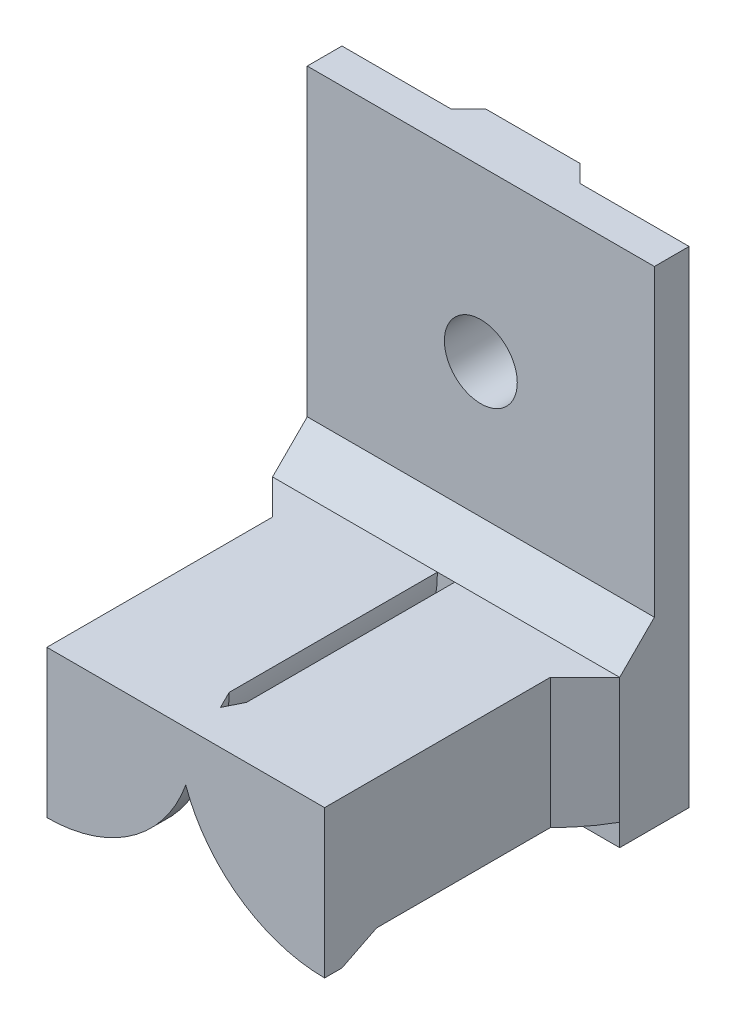
ISO-10303-21;
HEADER;
FILE_DESCRIPTION(('STEP AP214'),'2;1');
FILE_NAME('part.step','',(''),(''),'','','');
FILE_SCHEMA(('AUTOMOTIVE_DESIGN { 1 0 10303 214 1 1 1 1 }'));
ENDSEC;
DATA;
#1=APPLICATION_CONTEXT('core data for automotive mechanical design processes');
#2=APPLICATION_PROTOCOL_DEFINITION('international standard','automotive_design',2000,#1);
#3=PRODUCT_CONTEXT('',#1,'mechanical');
#4=PRODUCT('Part','Part','',(#3));
#5=PRODUCT_RELATED_PRODUCT_CATEGORY('part','',(#4));
#6=PRODUCT_DEFINITION_FORMATION('','',#4);
#7=PRODUCT_DEFINITION_CONTEXT('part definition',#1,'design');
#8=PRODUCT_DEFINITION('design','',#6,#7);
#9=PRODUCT_DEFINITION_SHAPE('','',#8);
#10=(LENGTH_UNIT() NAMED_UNIT(*) SI_UNIT(.MILLI.,.METRE.));
#11=(NAMED_UNIT(*) PLANE_ANGLE_UNIT() SI_UNIT($,.RADIAN.));
#12=(NAMED_UNIT(*) SI_UNIT($,.STERADIAN.) SOLID_ANGLE_UNIT());
#13=UNCERTAINTY_MEASURE_WITH_UNIT(LENGTH_MEASURE(1.E-05),#10,'distance_accuracy_value','');
#14=(GEOMETRIC_REPRESENTATION_CONTEXT(3) GLOBAL_UNCERTAINTY_ASSIGNED_CONTEXT((#13)) GLOBAL_UNIT_ASSIGNED_CONTEXT((#10,
#11,#12)) REPRESENTATION_CONTEXT('',''));
#15=CARTESIAN_POINT('',(0.,0.,0.));
#16=DIRECTION('',(0.,0.,1.));
#17=DIRECTION('',(1.,0.,0.));
#18=AXIS2_PLACEMENT_3D('',#15,#16,#17);
#19=CARTESIAN_POINT('',(-8.00000000000002,18.500000014901,348.000000000001));
#20=DIRECTION('',(0.,0.,-1.));
#21=DIRECTION('',(-1.,0.,0.));
#22=AXIS2_PLACEMENT_3D('',#19,#20,#21);
#23=CYLINDRICAL_SURFACE('',#22,8.50000001490115);
#24=CARTESIAN_POINT('',(-8.00000000000002,18.500000014901,347.000000005962));
#25=DIRECTION('',(0.,0.,1.));
#26=DIRECTION('',(0.,-1.,0.));
#27=AXIS2_PLACEMENT_3D('',#24,#25,#26);
#28=CIRCLE('',#27,8.50000000298022);
#29=CARTESIAN_POINT('',(0.,15.6277186651736,347.000000017882));
#30=VERTEX_POINT('',#29);
#31=CARTESIAN_POINT('',(-8.00000000000002,10.0000000039735,347.000000001988));
#32=VERTEX_POINT('',#31);
#33=EDGE_CURVE('E186',#30,#32,#28,.F.);
#34=ORIENTED_EDGE('',*,*,#33,.F.);
#35=DIRECTION('',(0.,0.,-1.));
#36=VECTOR('',#35,1.);
#37=CARTESIAN_POINT('',(0.,15.6277186475347,348.000000000001));
#38=LINE('',#37,#36);
#39=CARTESIAN_POINT('',(0.,15.6277186475347,348.000000000001));
#40=VERTEX_POINT('',#39);
#41=EDGE_CURVE('E164',#40,#30,#38,.T.);
#42=ORIENTED_EDGE('',*,*,#41,.F.);
#43=CARTESIAN_POINT('',(-8.00000000000002,18.500000014901,348.000000000001));
#44=DIRECTION('',(0.,0.,-1.));
#45=DIRECTION('',(-1.,0.,0.));
#46=AXIS2_PLACEMENT_3D('',#43,#44,#45);
#47=CIRCLE('',#46,8.50000001490115);
#48=CARTESIAN_POINT('',(-8.00000000000002,9.99999999999985,348.000000000001));
#49=VERTEX_POINT('',#48);
#50=EDGE_CURVE('E197',#49,#40,#47,.F.);
#51=ORIENTED_EDGE('',*,*,#50,.F.);
#52=DIRECTION('',(0.,0.,-1.));
#53=VECTOR('',#52,1.);
#54=CARTESIAN_POINT('',(-8.00000000000002,9.99999999999985,348.000000000001));
#55=LINE('',#54,#53);
#56=EDGE_CURVE('E176',#49,#32,#55,.T.);
#57=ORIENTED_EDGE('',*,*,#56,.T.);
#58=EDGE_LOOP('',(#34,#42,#51,#57));
#59=FACE_BOUND('',#58,.T.);
#60=ADVANCED_FACE('F16',(#59),#23,.T.);
#61=CARTESIAN_POINT('',(7.99999999999996,18.500000014901,348.000000000001));
#62=DIRECTION('',(0.,0.,-1.));
#63=DIRECTION('',(-1.,0.,0.));
#64=AXIS2_PLACEMENT_3D('',#61,#62,#63);
#65=CYLINDRICAL_SURFACE('',#64,8.50000001490115);
#66=CARTESIAN_POINT('',(7.99999999999996,18.500000014901,347.000000005962));
#67=DIRECTION('',(0.,0.,1.));
#68=DIRECTION('',(-1.,0.,0.));
#69=AXIS2_PLACEMENT_3D('',#66,#67,#68);
#70=CIRCLE('',#69,8.50000000298021);
#71=CARTESIAN_POINT('',(7.99999999999996,10.0000000039735,347.000000001988));
#72=VERTEX_POINT('',#71);
#73=EDGE_CURVE('E167',#72,#30,#70,.F.);
#74=ORIENTED_EDGE('',*,*,#73,.F.);
#75=DIRECTION('',(0.,0.,-1.));
#76=VECTOR('',#75,1.);
#77=CARTESIAN_POINT('',(7.99999999999996,9.99999999999985,348.000000000001));
#78=LINE('',#77,#76);
#79=CARTESIAN_POINT('',(7.99999999999996,9.99999999999985,348.000000000001));
#80=VERTEX_POINT('',#79);
#81=EDGE_CURVE('E175',#72,#80,#78,.F.);
#82=ORIENTED_EDGE('',*,*,#81,.T.);
#83=CARTESIAN_POINT('',(7.99999999999996,18.500000014901,348.000000000001));
#84=DIRECTION('',(0.,0.,-1.));
#85=DIRECTION('',(-1.,0.,0.));
#86=AXIS2_PLACEMENT_3D('',#83,#84,#85);
#87=CIRCLE('',#86,8.50000001490115);
#88=EDGE_CURVE('E170',#40,#80,#87,.F.);
#89=ORIENTED_EDGE('',*,*,#88,.F.);
#90=ORIENTED_EDGE('',*,*,#41,.T.);
#91=EDGE_LOOP('',(#74,#82,#89,#90));
#92=FACE_BOUND('',#91,.T.);
#93=ADVANCED_FACE('F166',(#92),#65,.T.);
#94=CARTESIAN_POINT('',(7.99999999999996,18.500000014901,347.000000005962));
#95=DIRECTION('',(0.,0.,1.));
#96=DIRECTION('',(1.,0.,0.));
#97=AXIS2_PLACEMENT_3D('',#94,#95,#96);
#98=CONICAL_SURFACE('',#97,8.50000000298021,0.463647609000802);
#99=DIRECTION('',(0.,0.44721360083114,-0.894427188334325));
#100=VECTOR('',#99,1.);
#101=CARTESIAN_POINT('',(7.99999999999996,9.99999999999989,347.000000000001));
#102=LINE('',#101,#100);
#103=CARTESIAN_POINT('',(7.99999999999996,11.000000014901,345.000000000001));
#104=VERTEX_POINT('',#103);
#105=EDGE_CURVE('E183',#72,#104,#102,.T.);
#106=ORIENTED_EDGE('',*,*,#105,.F.);
#107=ORIENTED_EDGE('',*,*,#73,.T.);
#108=CARTESIAN_POINT('',(0.,18.500000014901,346.000000000001));
#109=CARTESIAN_POINT('',(0.,18.4262201647426,345.999993626271));
#110=CARTESIAN_POINT('',(0.,18.3524561683724,346.00204240683));
#111=CARTESIAN_POINT('',(0.,18.2051667180088,346.010186352399));
#112=CARTESIAN_POINT('',(0.,18.1316412178106,346.016280679968));
#113=CARTESIAN_POINT('',(0.,17.9120855170067,346.0404934505));
#114=CARTESIAN_POINT('',(0.,17.7666728358507,346.06454239593));
#115=CARTESIAN_POINT('',(0.,17.4824774607516,346.12647905004));
#116=CARTESIAN_POINT('',(0.,17.3436192553142,346.16402910153));
#117=CARTESIAN_POINT('',(0.,17.0697933399129,346.251426134025));
#118=CARTESIAN_POINT('',(0.,16.9348272726317,346.301278224686));
#119=CARTESIAN_POINT('',(0.,16.699788935803,346.398870235824));
#120=CARTESIAN_POINT('',(0.,16.5988141592601,346.444471540052));
#121=CARTESIAN_POINT('',(0.,16.3995526330471,346.541165853297));
#122=CARTESIAN_POINT('',(0.,16.3012654947911,346.592258063101));
#123=CARTESIAN_POINT('',(0.,16.1054930631954,346.700255430901));
#124=CARTESIAN_POINT('',(0.,16.0080591560776,346.757253159034));
#125=CARTESIAN_POINT('',(0.,15.8158971321666,346.875553965992));
#126=CARTESIAN_POINT('',(0.,15.7211677995215,346.936855065944));
#127=CARTESIAN_POINT('',(0.,15.6277186618509,347.000000020128));
#128=B_SPLINE_CURVE_WITH_KNOTS('',3,(#108,#109,#110,#111,#112,#113,#114,#115,#116,#117,#118,
#119,#120,#121,#122,#123,#124,#125,#126,#127),.UNSPECIFIED.,.F.,.F.,(4,2,2,2,2,2,2,2,2,4),(0.,
0.221280695846479,0.442515600157778,0.883782117836499,1.3147034825508,1.74580413273469,
2.07801623878077,2.41018005598622,2.74870384904664,3.08707298141812),.UNSPECIFIED.);
#129=CARTESIAN_POINT('',(0.,18.500000014901,346.000000000001));
#130=VERTEX_POINT('',#129);
#131=EDGE_CURVE('E19',#130,#30,#128,.T.);
#132=ORIENTED_EDGE('',*,*,#131,.F.);
#133=DIRECTION('',(0.447213595499954,0.,-0.894427190999918));
#134=VECTOR('',#133,1.);
#135=CARTESIAN_POINT('',(0.,18.500000014901,346.000000000001));
#136=LINE('',#135,#134);
#137=CARTESIAN_POINT('',(0.499999999999969,18.500000014901,345.000000000001));
#138=VERTEX_POINT('',#137);
#139=EDGE_CURVE('E158',#130,#138,#136,.T.);
#140=ORIENTED_EDGE('',*,*,#139,.T.);
#141=CARTESIAN_POINT('',(7.99999999999996,18.500000014901,345.000000000001));
#142=DIRECTION('',(0.,0.,1.));
#143=DIRECTION('',(0.,-1.,0.));
#144=AXIS2_PLACEMENT_3D('',#141,#142,#143);
#145=CIRCLE('',#144,7.49999999999999);
#146=EDGE_CURVE('E227',#104,#138,#145,.F.);
#147=ORIENTED_EDGE('',*,*,#146,.F.);
#148=EDGE_LOOP('',(#106,#107,#132,#140,#147));
#149=FACE_BOUND('',#148,.T.);
#150=ADVANCED_FACE('F179',(#149),#98,.T.);
#151=CARTESIAN_POINT('',(-8.00000000000002,18.500000014901,347.000000005962));
#152=DIRECTION('',(0.,0.,1.));
#153=DIRECTION('',(1.,0.,0.));
#154=AXIS2_PLACEMENT_3D('',#151,#152,#153);
#155=CONICAL_SURFACE('',#154,8.50000000298021,0.463647609000801);
#156=CARTESIAN_POINT('',(-8.00000000000002,18.500000014901,345.000000000001));
#157=DIRECTION('',(0.,0.,1.));
#158=DIRECTION('',(0.,-1.,0.));
#159=AXIS2_PLACEMENT_3D('',#156,#157,#158);
#160=CIRCLE('',#159,7.49999999999999);
#161=CARTESIAN_POINT('',(-0.500000000000026,18.500000014901,345.000000000001));
#162=VERTEX_POINT('',#161);
#163=CARTESIAN_POINT('',(-8.00000000000002,11.000000014901,345.000000000001));
#164=VERTEX_POINT('',#163);
#165=EDGE_CURVE('E194',#162,#164,#160,.F.);
#166=ORIENTED_EDGE('',*,*,#165,.F.);
#167=DIRECTION('',(-0.447213595499954,0.,-0.894427190999918));
#168=VECTOR('',#167,1.);
#169=CARTESIAN_POINT('',(0.,18.500000014901,346.000000000001));
#170=LINE('',#169,#168);
#171=EDGE_CURVE('E190',#162,#130,#170,.F.);
#172=ORIENTED_EDGE('',*,*,#171,.T.);
#173=ORIENTED_EDGE('',*,*,#131,.T.);
#174=ORIENTED_EDGE('',*,*,#33,.T.);
#175=DIRECTION('',(0.,-0.44721360083114,0.894427188334325));
#176=VECTOR('',#175,1.);
#177=CARTESIAN_POINT('',(-8.00000000000002,11.000000014901,345.000000000001));
#178=LINE('',#177,#176);
#179=EDGE_CURVE('E288',#164,#32,#178,.T.);
#180=ORIENTED_EDGE('',*,*,#179,.F.);
#181=EDGE_LOOP('',(#166,#172,#173,#174,#180));
#182=FACE_BOUND('',#181,.T.);
#183=ADVANCED_FACE('F193',(#182),#155,.T.);
#184=CARTESIAN_POINT('',(-4.25000000000002,14.750000014901,348.000000000001));
#185=DIRECTION('',(0.,0.,1.));
#186=DIRECTION('',(0.,-1.,0.));
#187=AXIS2_PLACEMENT_3D('',#184,#185,#186);
#188=PLANE('',#187);
#189=DIRECTION('',(0.,1.,0.));
#190=VECTOR('',#189,1.);
#191=CARTESIAN_POINT('',(7.99999999999996,11.000000014901,348.000000000001));
#192=LINE('',#191,#190);
#193=CARTESIAN_POINT('',(7.99999999999996,18.500000014901,348.000000000001));
#194=VERTEX_POINT('',#193);
#195=EDGE_CURVE('E228',#194,#80,#192,.F.);
#196=ORIENTED_EDGE('',*,*,#195,.F.);
#197=DIRECTION('',(1.,0.,0.));
#198=VECTOR('',#197,1.);
#199=CARTESIAN_POINT('',(-0.500000000000026,18.500000014901,348.000000000001));
#200=LINE('',#199,#198);
#201=CARTESIAN_POINT('',(-8.00000000000002,18.500000014901,348.000000000001));
#202=VERTEX_POINT('',#201);
#203=EDGE_CURVE('E278',#202,#194,#200,.T.);
#204=ORIENTED_EDGE('',*,*,#203,.F.);
#205=DIRECTION('',(0.,-1.,0.));
#206=VECTOR('',#205,1.);
#207=CARTESIAN_POINT('',(-8.00000000000002,18.500000014901,348.000000000001));
#208=LINE('',#207,#206);
#209=EDGE_CURVE('E285',#49,#202,#208,.F.);
#210=ORIENTED_EDGE('',*,*,#209,.F.);
#211=ORIENTED_EDGE('',*,*,#50,.T.);
#212=ORIENTED_EDGE('',*,*,#88,.T.);
#213=EDGE_LOOP('',(#196,#204,#210,#211,#212));
#214=FACE_BOUND('',#213,.T.);
#215=ADVANCED_FACE('F463',(#214),#188,.T.);
#216=CARTESIAN_POINT('',(7.99999999999996,11.000000014901,333.000000000001));
#217=DIRECTION('',(1.,0.,0.));
#218=DIRECTION('',(0.,1.,0.));
#219=AXIS2_PLACEMENT_3D('',#216,#217,#218);
#220=PLANE('',#219);
#221=ORIENTED_EDGE('',*,*,#105,.T.);
#222=DIRECTION('',(0.,0.,1.));
#223=VECTOR('',#222,1.);
#224=CARTESIAN_POINT('',(7.99999999999996,11.000000014901,333.000000000001));
#225=LINE('',#224,#223);
#226=CARTESIAN_POINT('',(7.99999999999997,11.000000014901,335.000000000001));
#227=VERTEX_POINT('',#226);
#228=EDGE_CURVE('E311',#227,#104,#225,.T.);
#229=ORIENTED_EDGE('',*,*,#228,.F.);
#230=DIRECTION('',(0.,1.,0.));
#231=VECTOR('',#230,1.);
#232=CARTESIAN_POINT('',(7.99999999999997,17.5000000074505,335.000000000001));
#233=LINE('',#232,#231);
#234=CARTESIAN_POINT('',(7.99999999999997,18.5000000149011,335.000000000001));
#235=VERTEX_POINT('',#234);
#236=EDGE_CURVE('E257',#235,#227,#233,.F.);
#237=ORIENTED_EDGE('',*,*,#236,.F.);
#238=DIRECTION('',(0.,0.,1.));
#239=VECTOR('',#238,1.);
#240=CARTESIAN_POINT('',(7.99999999999996,18.500000014901,333.000000000001));
#241=LINE('',#240,#239);
#242=EDGE_CURVE('E281',#194,#235,#241,.F.);
#243=ORIENTED_EDGE('',*,*,#242,.F.);
#244=ORIENTED_EDGE('',*,*,#195,.T.);
#245=ORIENTED_EDGE('',*,*,#81,.F.);
#246=EDGE_LOOP('',(#221,#229,#237,#243,#244,#245));
#247=FACE_BOUND('',#246,.T.);
#248=ADVANCED_FACE('F465',(#247),#220,.T.);
#249=CARTESIAN_POINT('',(7.99999999999996,18.500000014901,333.000000000001));
#250=DIRECTION('',(0.,0.,1.));
#251=DIRECTION('',(0.,-1.,0.));
#252=AXIS2_PLACEMENT_3D('',#249,#250,#251);
#253=CYLINDRICAL_SURFACE('',#252,7.49999999999999);
#254=CARTESIAN_POINT('',(7.99999999999996,18.500000014901,335.000000000001));
#255=DIRECTION('',(0.707106781186552,0.,0.707106781186543));
#256=DIRECTION('',(-0.707106781186543,0.,0.707106781186552));
#257=AXIS2_PLACEMENT_3D('',#254,#255,#256);
#258=ELLIPSE('',#257,10.6066017177983,7.49999999999999);
#259=CARTESIAN_POINT('',(9.99999999999996,11.2715838675006,333.000000000001));
#260=VERTEX_POINT('',#259);
#261=EDGE_CURVE('E253',#227,#260,#258,.T.);
#262=ORIENTED_EDGE('',*,*,#261,.F.);
#263=ORIENTED_EDGE('',*,*,#228,.T.);
#264=ORIENTED_EDGE('',*,*,#146,.T.);
#265=DIRECTION('',(0.,0.,1.));
#266=VECTOR('',#265,1.);
#267=CARTESIAN_POINT('',(0.499999999999973,18.500000014901,333.000000000001));
#268=LINE('',#267,#266);
#269=CARTESIAN_POINT('',(0.499999999999972,18.500000014901,333.000000000001));
#270=VERTEX_POINT('',#269);
#271=EDGE_CURVE('E319',#270,#138,#268,.T.);
#272=ORIENTED_EDGE('',*,*,#271,.F.);
#273=CARTESIAN_POINT('',(7.99999999999996,18.500000014901,333.000000000001));
#274=DIRECTION('',(0.,0.,1.));
#275=DIRECTION('',(0.,-1.,0.));
#276=AXIS2_PLACEMENT_3D('',#273,#274,#275);
#277=CIRCLE('',#276,7.49999999999999);
#278=EDGE_CURVE('E262',#260,#270,#277,.F.);
#279=ORIENTED_EDGE('',*,*,#278,.F.);
#280=EDGE_LOOP('',(#262,#263,#264,#272,#279));
#281=FACE_BOUND('',#280,.T.);
#282=ADVANCED_FACE('F328',(#281),#253,.T.);
#283=CARTESIAN_POINT('',(0.,23.9999999999999,333.000000000001));
#284=DIRECTION('',(0.,0.,1.));
#285=DIRECTION('',(0.,-1.,0.));
#286=AXIS2_PLACEMENT_3D('',#283,#284,#285);
#287=PLANE('',#286);
#288=ORIENTED_EDGE('',*,*,#278,.T.);
#289=DIRECTION('',(1.,0.,0.));
#290=VECTOR('',#289,1.);
#291=CARTESIAN_POINT('',(0.,18.500000014901,333.000000000001));
#292=LINE('',#291,#290);
#293=CARTESIAN_POINT('',(-0.500000000000028,18.500000014901,333.000000000001));
#294=VERTEX_POINT('',#293);
#295=EDGE_CURVE('E265',#270,#294,#292,.F.);
#296=ORIENTED_EDGE('',*,*,#295,.T.);
#297=CARTESIAN_POINT('',(-8.00000000000002,18.500000014901,333.000000000001));
#298=DIRECTION('',(0.,0.,1.));
#299=DIRECTION('',(0.,-1.,0.));
#300=AXIS2_PLACEMENT_3D('',#297,#298,#299);
#301=CIRCLE('',#300,7.49999999999999);
#302=CARTESIAN_POINT('',(-10.,11.2715838675006,333.000000000001));
#303=VERTEX_POINT('',#302);
#304=EDGE_CURVE('E258',#303,#294,#301,.T.);
#305=ORIENTED_EDGE('',*,*,#304,.F.);
#306=DIRECTION('',(0.,-1.,0.));
#307=VECTOR('',#306,1.);
#308=CARTESIAN_POINT('',(-10.,23.9999999999999,333.000000000001));
#309=LINE('',#308,#307);
#310=CARTESIAN_POINT('',(-10.,9.99999999999988,333.000000000001));
#311=VERTEX_POINT('',#310);
#312=EDGE_CURVE('E307',#303,#311,#309,.T.);
#313=ORIENTED_EDGE('',*,*,#312,.T.);
#314=DIRECTION('',(1.,0.,0.));
#315=VECTOR('',#314,1.);
#316=CARTESIAN_POINT('',(-10.,9.99999999999988,333.000000000001));
#317=LINE('',#316,#315);
#318=CARTESIAN_POINT('',(9.99999999999997,9.99999999999988,333.000000000001));
#319=VERTEX_POINT('',#318);
#320=EDGE_CURVE('E205',#319,#311,#317,.F.);
#321=ORIENTED_EDGE('',*,*,#320,.F.);
#322=DIRECTION('',(0.,-1.,0.));
#323=VECTOR('',#322,1.);
#324=CARTESIAN_POINT('',(9.99999999999997,23.9999999999999,333.000000000001));
#325=LINE('',#324,#323);
#326=EDGE_CURVE('E266',#319,#260,#325,.F.);
#327=ORIENTED_EDGE('',*,*,#326,.T.);
#328=EDGE_LOOP('',(#288,#296,#305,#313,#321,#327));
#329=FACE_BOUND('',#328,.T.);
#330=ADVANCED_FACE('F457',(#329),#287,.T.);
#331=CARTESIAN_POINT('',(-8.00000000000002,18.500000014901,333.000000000001));
#332=DIRECTION('',(0.,0.,1.));
#333=DIRECTION('',(0.,-1.,0.));
#334=AXIS2_PLACEMENT_3D('',#331,#332,#333);
#335=CYLINDRICAL_SURFACE('',#334,7.49999999999999);
#336=ORIENTED_EDGE('',*,*,#304,.T.);
#337=DIRECTION('',(0.,0.,1.));
#338=VECTOR('',#337,1.);
#339=CARTESIAN_POINT('',(-0.500000000000026,18.500000014901,333.000000000001));
#340=LINE('',#339,#338);
#341=EDGE_CURVE('E333',#162,#294,#340,.F.);
#342=ORIENTED_EDGE('',*,*,#341,.F.);
#343=ORIENTED_EDGE('',*,*,#165,.T.);
#344=DIRECTION('',(0.,0.,1.));
#345=VECTOR('',#344,1.);
#346=CARTESIAN_POINT('',(-8.00000000000002,11.000000014901,333.000000000001));
#347=LINE('',#346,#345);
#348=CARTESIAN_POINT('',(-8.00000000000002,11.000000014901,335.000000000001));
#349=VERTEX_POINT('',#348);
#350=EDGE_CURVE('E261',#349,#164,#347,.T.);
#351=ORIENTED_EDGE('',*,*,#350,.F.);
#352=CARTESIAN_POINT('',(-8.00000000000002,18.500000014901,335.000000000001));
#353=DIRECTION('',(-0.707106781186553,0.,0.707106781186542));
#354=DIRECTION('',(0.707106781186542,0.,0.707106781186553));
#355=AXIS2_PLACEMENT_3D('',#352,#353,#354);
#356=ELLIPSE('',#355,10.6066017177983,7.49999999999999);
#357=EDGE_CURVE('E249',#303,#349,#356,.T.);
#358=ORIENTED_EDGE('',*,*,#357,.F.);
#359=EDGE_LOOP('',(#336,#342,#343,#351,#358));
#360=FACE_BOUND('',#359,.T.);
#361=ADVANCED_FACE('F459',(#360),#335,.T.);
#362=CARTESIAN_POINT('',(-8.00000000000002,18.500000014901,333.000000000001));
#363=DIRECTION('',(-1.,0.,0.));
#364=DIRECTION('',(0.,-1.,0.));
#365=AXIS2_PLACEMENT_3D('',#362,#363,#364);
#366=PLANE('',#365);
#367=ORIENTED_EDGE('',*,*,#209,.T.);
#368=DIRECTION('',(0.,0.,1.));
#369=VECTOR('',#368,1.);
#370=CARTESIAN_POINT('',(-8.00000000000002,18.500000014901,333.000000000001));
#371=LINE('',#370,#369);
#372=CARTESIAN_POINT('',(-8.00000000000003,18.500000014901,335.000000000001));
#373=VERTEX_POINT('',#372);
#374=EDGE_CURVE('E282',#373,#202,#371,.T.);
#375=ORIENTED_EDGE('',*,*,#374,.F.);
#376=DIRECTION('',(0.,1.,0.));
#377=VECTOR('',#376,1.);
#378=CARTESIAN_POINT('',(-8.00000000000003,21.2500000074505,335.000000000001));
#379=LINE('',#378,#377);
#380=EDGE_CURVE('E252',#349,#373,#379,.T.);
#381=ORIENTED_EDGE('',*,*,#380,.F.);
#382=ORIENTED_EDGE('',*,*,#350,.T.);
#383=ORIENTED_EDGE('',*,*,#179,.T.);
#384=ORIENTED_EDGE('',*,*,#56,.F.);
#385=EDGE_LOOP('',(#367,#375,#381,#382,#383,#384));
#386=FACE_BOUND('',#385,.T.);
#387=ADVANCED_FACE('F460',(#386),#366,.T.);
#388=CARTESIAN_POINT('',(2.71573593128774,37.9999999999999,328.000000000001));
#389=DIRECTION('',(0.707106781186545,0.,-0.70710678118655));
#390=DIRECTION('',(-0.70710678118655,0.,-0.707106781186545));
#391=AXIS2_PLACEMENT_3D('',#388,#389,#390);
#392=PLANE('',#391);
#393=DIRECTION('',(0.707106781186579,0.,0.707106781186516));
#394=VECTOR('',#393,1.);
#395=CARTESIAN_POINT('',(2.71573593128774,9.99999999999988,328.000000000001));
#396=LINE('',#395,#394);
#397=CARTESIAN_POINT('',(2.71573593128774,9.9999999999999,328.000000000001));
#398=VERTEX_POINT('',#397);
#399=CARTESIAN_POINT('',(3.71573593128781,9.9999999999999,329.000000000001));
#400=VERTEX_POINT('',#399);
#401=EDGE_CURVE('E405',#398,#400,#396,.T.);
#402=ORIENTED_EDGE('',*,*,#401,.F.);
#403=DIRECTION('',(0.,1.,0.));
#404=VECTOR('',#403,1.);
#405=CARTESIAN_POINT('',(2.71573593128774,37.9999999999999,328.000000000001));
#406=LINE('',#405,#404);
#407=CARTESIAN_POINT('',(2.71573593128774,37.9999999999999,328.000000000001));
#408=VERTEX_POINT('',#407);
#409=EDGE_CURVE('E354',#408,#398,#406,.F.);
#410=ORIENTED_EDGE('',*,*,#409,.F.);
#411=DIRECTION('',(-0.70710678118655,0.,-0.707106781186545));
#412=VECTOR('',#411,1.);
#413=CARTESIAN_POINT('',(2.71573593128774,37.9999999999999,328.000000000001));
#414=LINE('',#413,#412);
#415=CARTESIAN_POINT('',(3.71573593128781,37.9999999999999,329.000000000001));
#416=VERTEX_POINT('',#415);
#417=EDGE_CURVE('E287',#408,#416,#414,.F.);
#418=ORIENTED_EDGE('',*,*,#417,.T.);
#419=DIRECTION('',(0.,-1.,0.));
#420=VECTOR('',#419,1.);
#421=CARTESIAN_POINT('',(3.71573593128783,23.9999999999999,329.000000000001));
#422=LINE('',#421,#420);
#423=EDGE_CURVE('E256',#416,#400,#422,.T.);
#424=ORIENTED_EDGE('',*,*,#423,.T.);
#425=EDGE_LOOP('',(#402,#410,#418,#424));
#426=FACE_BOUND('',#425,.T.);
#427=ADVANCED_FACE('F351',(#426),#392,.T.);
#428=CARTESIAN_POINT('',(-3.71573593128844,37.9999999999999,329.000000000001));
#429=DIRECTION('',(-0.707106781186548,0.,-0.707106781186547));
#430=DIRECTION('',(-0.707106781186547,0.,0.707106781186548));
#431=AXIS2_PLACEMENT_3D('',#428,#429,#430);
#432=PLANE('',#431);
#433=DIRECTION('',(0.707106781186579,0.,-0.707106781186516));
#434=VECTOR('',#433,1.);
#435=CARTESIAN_POINT('',(-3.71573593128844,9.99999999999988,329.000000000001));
#436=LINE('',#435,#434);
#437=CARTESIAN_POINT('',(-3.71573593128844,9.99999999999988,329.000000000001));
#438=VERTEX_POINT('',#437);
#439=CARTESIAN_POINT('',(-2.71573593128836,9.99999999999989,328.000000000001));
#440=VERTEX_POINT('',#439);
#441=EDGE_CURVE('E407',#438,#440,#436,.T.);
#442=ORIENTED_EDGE('',*,*,#441,.F.);
#443=DIRECTION('',(0.,-1.,0.));
#444=VECTOR('',#443,1.);
#445=CARTESIAN_POINT('',(-3.71573593128844,23.9999999999999,329.000000000001));
#446=LINE('',#445,#444);
#447=CARTESIAN_POINT('',(-3.71573593128844,37.9999999999999,329.000000000001));
#448=VERTEX_POINT('',#447);
#449=EDGE_CURVE('E365',#438,#448,#446,.F.);
#450=ORIENTED_EDGE('',*,*,#449,.T.);
#451=DIRECTION('',(-0.707106781186547,0.,0.707106781186548));
#452=VECTOR('',#451,1.);
#453=CARTESIAN_POINT('',(-3.71573593128844,37.9999999999999,329.000000000001));
#454=LINE('',#453,#452);
#455=CARTESIAN_POINT('',(-2.71573593128837,37.9999999999999,328.000000000001));
#456=VERTEX_POINT('',#455);
#457=EDGE_CURVE('E301',#448,#456,#454,.F.);
#458=ORIENTED_EDGE('',*,*,#457,.T.);
#459=DIRECTION('',(0.,1.,0.));
#460=VECTOR('',#459,1.);
#461=CARTESIAN_POINT('',(-2.71573593128835,37.9999999999999,328.000000000001));
#462=LINE('',#461,#460);
#463=EDGE_CURVE('E377',#440,#456,#462,.T.);
#464=ORIENTED_EDGE('',*,*,#463,.F.);
#465=EDGE_LOOP('',(#442,#450,#458,#464));
#466=FACE_BOUND('',#465,.T.);
#467=ADVANCED_FACE('F488',(#466),#432,.T.);
#468=CARTESIAN_POINT('',(-0.500000000000026,18.500000014901,333.000000000001));
#469=DIRECTION('',(0.,1.,0.));
#470=DIRECTION('',(0.,0.,1.));
#471=AXIS2_PLACEMENT_3D('',#468,#469,#470);
#472=PLANE('',#471);
#473=ORIENTED_EDGE('',*,*,#171,.F.);
#474=ORIENTED_EDGE('',*,*,#341,.T.);
#475=DIRECTION('',(1.,0.,0.));
#476=VECTOR('',#475,1.);
#477=CARTESIAN_POINT('',(-0.250000000000026,18.5000000149011,333.000000000001));
#478=LINE('',#477,#476);
#479=CARTESIAN_POINT('',(-10.,18.5000000149011,333.000000000001));
#480=VERTEX_POINT('',#479);
#481=EDGE_CURVE('E379',#480,#294,#478,.T.);
#482=ORIENTED_EDGE('',*,*,#481,.F.);
#483=DIRECTION('',(0.707106781186542,0.,0.707106781186553));
#484=VECTOR('',#483,1.);
#485=CARTESIAN_POINT('',(-9.00000000000002,18.500000014901,334.000000000001));
#486=LINE('',#485,#484);
#487=EDGE_CURVE('E208',#373,#480,#486,.F.);
#488=ORIENTED_EDGE('',*,*,#487,.F.);
#489=ORIENTED_EDGE('',*,*,#374,.T.);
#490=ORIENTED_EDGE('',*,*,#203,.T.);
#491=ORIENTED_EDGE('',*,*,#242,.T.);
#492=DIRECTION('',(0.707106781186543,0.,-0.707106781186552));
#493=VECTOR('',#492,1.);
#494=CARTESIAN_POINT('',(8.99999999999996,18.5000000149011,334.000000000001));
#495=LINE('',#494,#493);
#496=CARTESIAN_POINT('',(9.99999999999997,18.5000000149011,333.000000000001));
#497=VERTEX_POINT('',#496);
#498=EDGE_CURVE('E335',#497,#235,#495,.F.);
#499=ORIENTED_EDGE('',*,*,#498,.F.);
#500=DIRECTION('',(1.,0.,0.));
#501=VECTOR('',#500,1.);
#502=CARTESIAN_POINT('',(-0.250000000000026,18.500000014901,333.000000000001));
#503=LINE('',#502,#501);
#504=EDGE_CURVE('E332',#270,#497,#503,.T.);
#505=ORIENTED_EDGE('',*,*,#504,.F.);
#506=ORIENTED_EDGE('',*,*,#271,.T.);
#507=ORIENTED_EDGE('',*,*,#139,.F.);
#508=EDGE_LOOP('',(#473,#474,#482,#488,#489,#490,#491,#499,#505,#506,#507));
#509=FACE_BOUND('',#508,.T.);
#510=ADVANCED_FACE('F330',(#509),#472,.T.);
#511=CARTESIAN_POINT('',(8.99999999999996,17.5000000074505,334.000000000001));
#512=DIRECTION('',(0.707106781186552,0.,0.707106781186543));
#513=DIRECTION('',(0.707106781186543,0.,-0.707106781186552));
#514=AXIS2_PLACEMENT_3D('',#511,#512,#513);
#515=PLANE('',#514);
#516=ORIENTED_EDGE('',*,*,#261,.T.);
#517=DIRECTION('',(0.,1.,0.));
#518=VECTOR('',#517,1.);
#519=CARTESIAN_POINT('',(9.99999999999997,9.99999999999988,333.000000000001));
#520=LINE('',#519,#518);
#521=EDGE_CURVE('E216',#497,#260,#520,.F.);
#522=ORIENTED_EDGE('',*,*,#521,.F.);
#523=ORIENTED_EDGE('',*,*,#498,.T.);
#524=ORIENTED_EDGE('',*,*,#236,.T.);
#525=EDGE_LOOP('',(#516,#522,#523,#524));
#526=FACE_BOUND('',#525,.T.);
#527=ADVANCED_FACE('F467',(#526),#515,.T.);
#528=CARTESIAN_POINT('',(0.,23.9999999999999,329.000000000001));
#529=DIRECTION('',(0.,0.,1.));
#530=DIRECTION('',(0.,-1.,0.));
#531=AXIS2_PLACEMENT_3D('',#528,#529,#530);
#532=PLANE('',#531);
#533=DIRECTION('',(1.,0.,0.));
#534=VECTOR('',#533,1.);
#535=CARTESIAN_POINT('',(9.99999999999997,37.9999999999999,329.000000000001));
#536=LINE('',#535,#534);
#537=CARTESIAN_POINT('',(9.99999999999997,37.9999999999999,329.000000000001));
#538=VERTEX_POINT('',#537);
#539=EDGE_CURVE('E362',#538,#416,#536,.F.);
#540=ORIENTED_EDGE('',*,*,#539,.F.);
#541=DIRECTION('',(0.,1.,0.));
#542=VECTOR('',#541,1.);
#543=CARTESIAN_POINT('',(9.99999999999997,9.99999999999988,329.000000000001));
#544=LINE('',#543,#542);
#545=CARTESIAN_POINT('',(9.99999999999997,9.99999999999988,329.000000000001));
#546=VERTEX_POINT('',#545);
#547=EDGE_CURVE('E215',#546,#538,#544,.T.);
#548=ORIENTED_EDGE('',*,*,#547,.F.);
#549=DIRECTION('',(1.,0.,0.));
#550=VECTOR('',#549,1.);
#551=CARTESIAN_POINT('',(-10.,9.99999999999988,329.000000000001));
#552=LINE('',#551,#550);
#553=EDGE_CURVE('E209',#400,#546,#552,.T.);
#554=ORIENTED_EDGE('',*,*,#553,.F.);
#555=ORIENTED_EDGE('',*,*,#423,.F.);
#556=EDGE_LOOP('',(#540,#548,#554,#555));
#557=FACE_BOUND('',#556,.T.);
#558=ADVANCED_FACE('F360',(#557),#532,.F.);
#559=CARTESIAN_POINT('',(0.,23.9999999999999,329.000000000001));
#560=DIRECTION('',(0.,0.,1.));
#561=DIRECTION('',(0.,-1.,0.));
#562=AXIS2_PLACEMENT_3D('',#559,#560,#561);
#563=PLANE('',#562);
#564=DIRECTION('',(1.,0.,0.));
#565=VECTOR('',#564,1.);
#566=CARTESIAN_POINT('',(-10.,9.99999999999988,329.000000000001));
#567=LINE('',#566,#565);
#568=CARTESIAN_POINT('',(-10.,9.99999999999988,329.000000000001));
#569=VERTEX_POINT('',#568);
#570=EDGE_CURVE('E409',#569,#438,#567,.T.);
#571=ORIENTED_EDGE('',*,*,#570,.F.);
#572=DIRECTION('',(0.,-1.,0.));
#573=VECTOR('',#572,1.);
#574=CARTESIAN_POINT('',(-10.,37.9999999999999,329.000000000001));
#575=LINE('',#574,#573);
#576=CARTESIAN_POINT('',(-10.,37.9999999999999,329.000000000001));
#577=VERTEX_POINT('',#576);
#578=EDGE_CURVE('E223',#577,#569,#575,.T.);
#579=ORIENTED_EDGE('',*,*,#578,.F.);
#580=DIRECTION('',(1.,0.,0.));
#581=VECTOR('',#580,1.);
#582=CARTESIAN_POINT('',(9.99999999999997,37.9999999999999,329.000000000001));
#583=LINE('',#582,#581);
#584=EDGE_CURVE('E371',#448,#577,#583,.F.);
#585=ORIENTED_EDGE('',*,*,#584,.F.);
#586=ORIENTED_EDGE('',*,*,#449,.F.);
#587=EDGE_LOOP('',(#571,#579,#585,#586));
#588=FACE_BOUND('',#587,.T.);
#589=ADVANCED_FACE('F478',(#588),#563,.F.);
#590=CARTESIAN_POINT('',(-10.,9.99999999999988,329.000000000001));
#591=DIRECTION('',(0.,-1.,0.));
#592=DIRECTION('',(0.,0.,-1.));
#593=AXIS2_PLACEMENT_3D('',#590,#591,#592);
#594=PLANE('',#593);
#595=ORIENTED_EDGE('',*,*,#320,.T.);
#596=DIRECTION('',(0.,0.,1.));
#597=VECTOR('',#596,1.);
#598=CARTESIAN_POINT('',(-10.,9.99999999999988,329.000000000001));
#599=LINE('',#598,#597);
#600=EDGE_CURVE('E219',#569,#311,#599,.T.);
#601=ORIENTED_EDGE('',*,*,#600,.F.);
#602=ORIENTED_EDGE('',*,*,#570,.T.);
#603=ORIENTED_EDGE('',*,*,#441,.T.);
#604=DIRECTION('',(-1.,0.,0.));
#605=VECTOR('',#604,1.);
#606=CARTESIAN_POINT('',(-2.71573593128835,9.9999999999999,328.000000000001));
#607=LINE('',#606,#605);
#608=EDGE_CURVE('E380',#398,#440,#607,.T.);
#609=ORIENTED_EDGE('',*,*,#608,.F.);
#610=ORIENTED_EDGE('',*,*,#401,.T.);
#611=ORIENTED_EDGE('',*,*,#553,.T.);
#612=DIRECTION('',(0.,0.,1.));
#613=VECTOR('',#612,1.);
#614=CARTESIAN_POINT('',(9.99999999999997,9.99999999999988,329.000000000001));
#615=LINE('',#614,#613);
#616=EDGE_CURVE('E212',#319,#546,#615,.F.);
#617=ORIENTED_EDGE('',*,*,#616,.F.);
#618=EDGE_LOOP('',(#595,#601,#602,#603,#609,#610,#611,#617));
#619=FACE_BOUND('',#618,.T.);
#620=ADVANCED_FACE('F481',(#619),#594,.T.);
#621=CARTESIAN_POINT('',(-9.00000000000002,21.2500000074505,334.000000000001));
#622=DIRECTION('',(-0.707106781186553,0.,0.707106781186542));
#623=DIRECTION('',(0.707106781186542,0.,0.707106781186553));
#624=AXIS2_PLACEMENT_3D('',#621,#622,#623);
#625=PLANE('',#624);
#626=ORIENTED_EDGE('',*,*,#357,.T.);
#627=ORIENTED_EDGE('',*,*,#380,.T.);
#628=ORIENTED_EDGE('',*,*,#487,.T.);
#629=DIRECTION('',(0.,-1.,0.));
#630=VECTOR('',#629,1.);
#631=CARTESIAN_POINT('',(-10.,37.9999999999999,333.000000000001));
#632=LINE('',#631,#630);
#633=EDGE_CURVE('E222',#303,#480,#632,.F.);
#634=ORIENTED_EDGE('',*,*,#633,.F.);
#635=EDGE_LOOP('',(#626,#627,#628,#634));
#636=FACE_BOUND('',#635,.T.);
#637=ADVANCED_FACE('F452',(#636),#625,.T.);
#638=CARTESIAN_POINT('',(-2.71573593128835,37.9999999999999,328.000000000001));
#639=DIRECTION('',(0.,0.,-1.));
#640=DIRECTION('',(-1.,0.,0.));
#641=AXIS2_PLACEMENT_3D('',#638,#639,#640);
#642=PLANE('',#641);
#643=CARTESIAN_POINT('',(0.,28.2500000074505,328.000000000001));
#644=DIRECTION('',(0.,0.,1.));
#645=DIRECTION('',(1.,0.,0.));
#646=AXIS2_PLACEMENT_3D('',#643,#644,#645);
#647=CIRCLE('',#646,2.1);
#648=CARTESIAN_POINT('',(2.09999999999997,28.2500000074505,328.000000000001));
#649=VERTEX_POINT('',#648);
#650=EDGE_CURVE('E244',#649,#649,#647,.T.);
#651=ORIENTED_EDGE('',*,*,#650,.T.);
#652=EDGE_LOOP('',(#651));
#653=FACE_BOUND('',#652,.T.);
#654=ORIENTED_EDGE('',*,*,#608,.T.);
#655=ORIENTED_EDGE('',*,*,#463,.T.);
#656=DIRECTION('',(1.,0.,0.));
#657=VECTOR('',#656,1.);
#658=CARTESIAN_POINT('',(9.99999999999997,37.9999999999999,328.000000000001));
#659=LINE('',#658,#657);
#660=EDGE_CURVE('E369',#408,#456,#659,.F.);
#661=ORIENTED_EDGE('',*,*,#660,.F.);
#662=ORIENTED_EDGE('',*,*,#409,.T.);
#663=EDGE_LOOP('',(#654,#655,#661,#662));
#664=FACE_BOUND('',#663,.T.);
#665=ADVANCED_FACE('F487',(#653,#664),#642,.T.);
#666=CARTESIAN_POINT('',(-0.250000000000026,19.500000014901,332.000000000001));
#667=DIRECTION('',(0.,0.707106781186548,0.707106781186547));
#668=DIRECTION('',(0.,-0.707106781186547,0.707106781186548));
#669=AXIS2_PLACEMENT_3D('',#666,#667,#668);
#670=PLANE('',#669);
#671=ORIENTED_EDGE('',*,*,#295,.F.);
#672=ORIENTED_EDGE('',*,*,#504,.T.);
#673=DIRECTION('',(0.,-0.707106781186547,0.707106781186547));
#674=VECTOR('',#673,1.);
#675=CARTESIAN_POINT('',(9.99999999999997,20.5000000149011,331.000000000001));
#676=LINE('',#675,#674);
#677=CARTESIAN_POINT('',(9.99999999999997,20.5000000149011,331.000000000001));
#678=VERTEX_POINT('',#677);
#679=EDGE_CURVE('E419',#678,#497,#676,.T.);
#680=ORIENTED_EDGE('',*,*,#679,.F.);
#681=DIRECTION('',(1.,0.,0.));
#682=VECTOR('',#681,1.);
#683=CARTESIAN_POINT('',(0.,20.5000000149011,331.000000000001));
#684=LINE('',#683,#682);
#685=CARTESIAN_POINT('',(-10.,20.5000000149011,331.000000000001));
#686=VERTEX_POINT('',#685);
#687=EDGE_CURVE('E247',#686,#678,#684,.T.);
#688=ORIENTED_EDGE('',*,*,#687,.F.);
#689=DIRECTION('',(0.,0.707106781186547,-0.707106781186547));
#690=VECTOR('',#689,1.);
#691=CARTESIAN_POINT('',(-10.,18.5000000149011,333.000000000001));
#692=LINE('',#691,#690);
#693=EDGE_CURVE('E248',#480,#686,#692,.T.);
#694=ORIENTED_EDGE('',*,*,#693,.F.);
#695=ORIENTED_EDGE('',*,*,#481,.T.);
#696=EDGE_LOOP('',(#671,#672,#680,#688,#694,#695));
#697=FACE_BOUND('',#696,.T.);
#698=ADVANCED_FACE('F446',(#697),#670,.T.);
#699=CARTESIAN_POINT('',(9.99999999999997,9.99999999999988,329.000000000001));
#700=DIRECTION('',(1.,0.,0.));
#701=DIRECTION('',(0.,1.,0.));
#702=AXIS2_PLACEMENT_3D('',#699,#700,#701);
#703=PLANE('',#702);
#704=ORIENTED_EDGE('',*,*,#547,.T.);
#705=DIRECTION('',(0.,0.,1.));
#706=VECTOR('',#705,1.);
#707=CARTESIAN_POINT('',(9.99999999999997,37.9999999999999,329.000000000001));
#708=LINE('',#707,#706);
#709=CARTESIAN_POINT('',(9.99999999999997,37.9999999999999,331.000000000001));
#710=VERTEX_POINT('',#709);
#711=EDGE_CURVE('E368',#710,#538,#708,.F.);
#712=ORIENTED_EDGE('',*,*,#711,.F.);
#713=DIRECTION('',(0.,-1.,0.));
#714=VECTOR('',#713,1.);
#715=CARTESIAN_POINT('',(9.99999999999997,28.2500000074505,331.000000000001));
#716=LINE('',#715,#714);
#717=EDGE_CURVE('E433',#678,#710,#716,.F.);
#718=ORIENTED_EDGE('',*,*,#717,.F.);
#719=ORIENTED_EDGE('',*,*,#679,.T.);
#720=ORIENTED_EDGE('',*,*,#521,.T.);
#721=ORIENTED_EDGE('',*,*,#326,.F.);
#722=ORIENTED_EDGE('',*,*,#616,.T.);
#723=EDGE_LOOP('',(#704,#712,#718,#719,#720,#721,#722));
#724=FACE_BOUND('',#723,.T.);
#725=ADVANCED_FACE('F469',(#724),#703,.T.);
#726=CARTESIAN_POINT('',(9.99999999999997,37.9999999999999,329.000000000001));
#727=DIRECTION('',(0.,1.,0.));
#728=DIRECTION('',(0.,0.,1.));
#729=AXIS2_PLACEMENT_3D('',#726,#727,#728);
#730=PLANE('',#729);
#731=ORIENTED_EDGE('',*,*,#584,.T.);
#732=DIRECTION('',(0.,0.,1.));
#733=VECTOR('',#732,1.);
#734=CARTESIAN_POINT('',(-10.,37.9999999999999,329.000000000001));
#735=LINE('',#734,#733);
#736=CARTESIAN_POINT('',(-10.,37.9999999999999,331.000000000001));
#737=VERTEX_POINT('',#736);
#738=EDGE_CURVE('E40',#737,#577,#735,.F.);
#739=ORIENTED_EDGE('',*,*,#738,.F.);
#740=DIRECTION('',(1.,0.,0.));
#741=VECTOR('',#740,1.);
#742=CARTESIAN_POINT('',(0.,37.9999999999999,331.000000000001));
#743=LINE('',#742,#741);
#744=EDGE_CURVE('E436',#710,#737,#743,.F.);
#745=ORIENTED_EDGE('',*,*,#744,.F.);
#746=ORIENTED_EDGE('',*,*,#711,.T.);
#747=ORIENTED_EDGE('',*,*,#539,.T.);
#748=ORIENTED_EDGE('',*,*,#417,.F.);
#749=ORIENTED_EDGE('',*,*,#660,.T.);
#750=ORIENTED_EDGE('',*,*,#457,.F.);
#751=EDGE_LOOP('',(#731,#739,#745,#746,#747,#748,#749,#750));
#752=FACE_BOUND('',#751,.T.);
#753=ADVANCED_FACE('F367',(#752),#730,.T.);
#754=CARTESIAN_POINT('',(-10.,37.9999999999999,329.000000000001));
#755=DIRECTION('',(-1.,0.,0.));
#756=DIRECTION('',(0.,-1.,0.));
#757=AXIS2_PLACEMENT_3D('',#754,#755,#756);
#758=PLANE('',#757);
#759=ORIENTED_EDGE('',*,*,#633,.T.);
#760=ORIENTED_EDGE('',*,*,#693,.T.);
#761=DIRECTION('',(0.,-1.,0.));
#762=VECTOR('',#761,1.);
#763=CARTESIAN_POINT('',(-10.,28.2500000074505,331.000000000001));
#764=LINE('',#763,#762);
#765=EDGE_CURVE('E31',#737,#686,#764,.T.);
#766=ORIENTED_EDGE('',*,*,#765,.F.);
#767=ORIENTED_EDGE('',*,*,#738,.T.);
#768=ORIENTED_EDGE('',*,*,#578,.T.);
#769=ORIENTED_EDGE('',*,*,#600,.T.);
#770=ORIENTED_EDGE('',*,*,#312,.F.);
#771=EDGE_LOOP('',(#759,#760,#766,#767,#768,#769,#770));
#772=FACE_BOUND('',#771,.T.);
#773=ADVANCED_FACE('F448',(#772),#758,.T.);
#774=CARTESIAN_POINT('',(0.,28.2500000074505,329.000000000001));
#775=DIRECTION('',(0.,0.,1.));
#776=DIRECTION('',(1.,0.,0.));
#777=AXIS2_PLACEMENT_3D('',#774,#775,#776);
#778=CYLINDRICAL_SURFACE('',#777,2.1);
#779=ORIENTED_EDGE('',*,*,#650,.F.);
#780=EDGE_LOOP('',(#779));
#781=FACE_BOUND('',#780,.T.);
#782=CARTESIAN_POINT('',(0.,28.2500000074505,331.000000000001));
#783=DIRECTION('',(0.,0.,1.));
#784=DIRECTION('',(1.,0.,0.));
#785=AXIS2_PLACEMENT_3D('',#782,#783,#784);
#786=CIRCLE('',#785,2.1);
#787=CARTESIAN_POINT('',(2.09999999999997,28.2500000074505,331.000000000001));
#788=VERTEX_POINT('',#787);
#789=EDGE_CURVE('E11',#788,#788,#786,.F.);
#790=ORIENTED_EDGE('',*,*,#789,.F.);
#791=EDGE_LOOP('',(#790));
#792=FACE_BOUND('',#791,.T.);
#793=ADVANCED_FACE('F499',(#781,#792),#778,.F.);
#794=CARTESIAN_POINT('',(0.,28.2500000074505,331.000000000001));
#795=DIRECTION('',(0.,0.,1.));
#796=DIRECTION('',(0.,-1.,0.));
#797=AXIS2_PLACEMENT_3D('',#794,#795,#796);
#798=PLANE('',#797);
#799=ORIENTED_EDGE('',*,*,#789,.T.);
#800=EDGE_LOOP('',(#799));
#801=FACE_BOUND('',#800,.T.);
#802=ORIENTED_EDGE('',*,*,#744,.T.);
#803=ORIENTED_EDGE('',*,*,#765,.T.);
#804=ORIENTED_EDGE('',*,*,#687,.T.);
#805=ORIENTED_EDGE('',*,*,#717,.T.);
#806=EDGE_LOOP('',(#802,#803,#804,#805));
#807=FACE_BOUND('',#806,.T.);
#808=ADVANCED_FACE('F442',(#801,#807),#798,.T.);
#809=CLOSED_SHELL('',(#60,#93,#150,#183,#215,#248,#282,#330,#361,#387,#427,#467,#510,#527,#558,
#589,#620,#637,#665,#698,#725,#753,#773,#793,#808));
#810=MANIFOLD_SOLID_BREP('B1',#809);
#811=ADVANCED_BREP_SHAPE_REPRESENTATION('',(#18,#810),#14);
#812=SHAPE_DEFINITION_REPRESENTATION(#9,#811);
ENDSEC;
END-ISO-10303-21;
